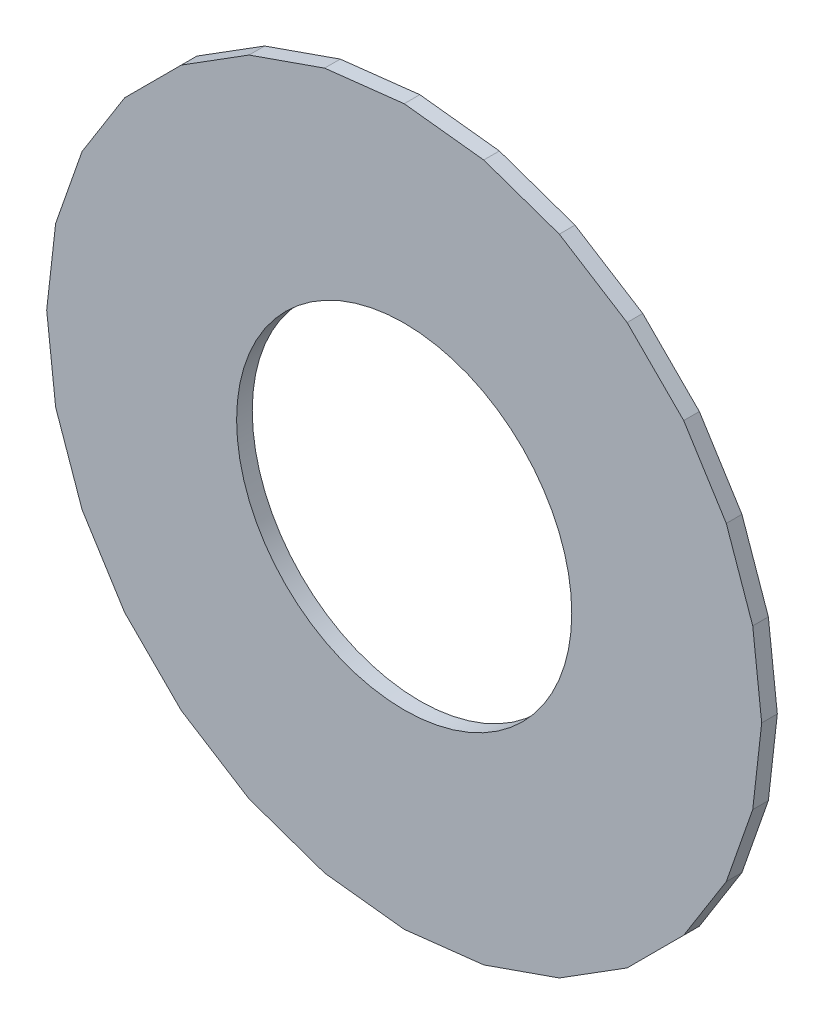
ISO-10303-21;
HEADER;
FILE_DESCRIPTION(('STEP AP214'),'2;1');
FILE_NAME('part.step','',(''),(''),'','','');
FILE_SCHEMA(('AUTOMOTIVE_DESIGN { 1 0 10303 214 1 1 1 1 }'));
ENDSEC;
DATA;
#1=APPLICATION_CONTEXT('core data for automotive mechanical design processes');
#2=APPLICATION_PROTOCOL_DEFINITION('international standard','automotive_design',2000,#1);
#3=PRODUCT_CONTEXT('',#1,'mechanical');
#4=PRODUCT('Part','Part','',(#3));
#5=PRODUCT_RELATED_PRODUCT_CATEGORY('part','',(#4));
#6=PRODUCT_DEFINITION_FORMATION('','',#4);
#7=PRODUCT_DEFINITION_CONTEXT('part definition',#1,'design');
#8=PRODUCT_DEFINITION('design','',#6,#7);
#9=PRODUCT_DEFINITION_SHAPE('','',#8);
#10=(LENGTH_UNIT() NAMED_UNIT(*) SI_UNIT(.MILLI.,.METRE.));
#11=(NAMED_UNIT(*) PLANE_ANGLE_UNIT() SI_UNIT($,.RADIAN.));
#12=(NAMED_UNIT(*) SI_UNIT($,.STERADIAN.) SOLID_ANGLE_UNIT());
#13=UNCERTAINTY_MEASURE_WITH_UNIT(LENGTH_MEASURE(1.E-05),#10,'distance_accuracy_value','');
#14=(GEOMETRIC_REPRESENTATION_CONTEXT(3) GLOBAL_UNCERTAINTY_ASSIGNED_CONTEXT((#13)) GLOBAL_UNIT_ASSIGNED_CONTEXT((#10,
#11,#12)) REPRESENTATION_CONTEXT('',''));
#15=CARTESIAN_POINT('',(0.,0.,0.));
#16=DIRECTION('',(0.,0.,1.));
#17=DIRECTION('',(1.,0.,0.));
#18=AXIS2_PLACEMENT_3D('',#15,#16,#17);
#19=CARTESIAN_POINT('',(170.307,-143.637,-0.045));
#20=DIRECTION('',(0.,0.,-1.));
#21=DIRECTION('',(0.,-1.,0.));
#22=AXIS2_PLACEMENT_3D('',#19,#20,#21);
#23=CYLINDRICAL_SURFACE('',#22,0.375);
#24=CARTESIAN_POINT('',(170.307,-143.637,1.67));
#25=DIRECTION('',(0.,0.,-1.));
#26=DIRECTION('',(0.,-1.,0.));
#27=AXIS2_PLACEMENT_3D('',#24,#25,#26);
#28=CIRCLE('',#27,0.375);
#29=CARTESIAN_POINT('',(170.307,-144.012,1.67));
#30=VERTEX_POINT('',#29);
#31=EDGE_CURVE('E292',#30,#30,#28,.T.);
#32=ORIENTED_EDGE('',*,*,#31,.T.);
#33=DIRECTION('',(0.,0.,1.));
#34=VECTOR('',#33,1.);
#35=CARTESIAN_POINT('',(170.307,-144.012,-0.045));
#36=LINE('',#35,#34);
#37=CARTESIAN_POINT('',(170.307,-144.012,1.705));
#38=VERTEX_POINT('',#37);
#39=EDGE_CURVE('E11',#30,#38,#36,.T.);
#40=ORIENTED_EDGE('',*,*,#39,.T.);
#41=CARTESIAN_POINT('',(170.307,-143.637,1.705));
#42=DIRECTION('',(0.,0.,-1.));
#43=DIRECTION('',(0.,-1.,0.));
#44=AXIS2_PLACEMENT_3D('',#41,#42,#43);
#45=CIRCLE('',#44,0.375);
#46=EDGE_CURVE('E378',#38,#38,#45,.T.);
#47=ORIENTED_EDGE('',*,*,#46,.F.);
#48=ORIENTED_EDGE('',*,*,#39,.F.);
#49=EDGE_LOOP('',(#32,#40,#47,#48));
#50=FACE_BOUND('',#49,.T.);
#51=ADVANCED_FACE('F17',(#50),#23,.F.);
#52=CARTESIAN_POINT('',(170.128983,-144.416942,1.67));
#53=DIRECTION('',(-0.330278315977027,-0.943883591337077,0.));
#54=DIRECTION('',(-0.943883591337077,0.330278315977027,0.));
#55=AXIS2_PLACEMENT_3D('',#52,#53,#54);
#56=PLANE('',#55);
#57=DIRECTION('',(0.,0.,1.));
#58=VECTOR('',#57,1.);
#59=CARTESIAN_POINT('',(170.128983,-144.416942,1.67));
#60=LINE('',#59,#58);
#61=CARTESIAN_POINT('',(170.128983,-144.416942,1.67));
#62=VERTEX_POINT('',#61);
#63=CARTESIAN_POINT('',(170.128983,-144.416942,1.705));
#64=VERTEX_POINT('',#63);
#65=EDGE_CURVE('E25',#62,#64,#60,.T.);
#66=ORIENTED_EDGE('',*,*,#65,.T.);
#67=DIRECTION('',(-0.943883591337077,0.330278315977027,0.));
#68=VECTOR('',#67,1.);
#69=CARTESIAN_POINT('',(170.128983,-144.416942,1.705));
#70=LINE('',#69,#68);
#71=CARTESIAN_POINT('',(169.959893,-144.357775,1.705));
#72=VERTEX_POINT('',#71);
#73=EDGE_CURVE('E211',#64,#72,#70,.T.);
#74=ORIENTED_EDGE('',*,*,#73,.T.);
#75=DIRECTION('',(0.,0.,1.));
#76=VECTOR('',#75,1.);
#77=CARTESIAN_POINT('',(169.959893,-144.357775,1.67));
#78=LINE('',#77,#76);
#79=CARTESIAN_POINT('',(169.959893,-144.357775,1.67));
#80=VERTEX_POINT('',#79);
#81=EDGE_CURVE('E139',#80,#72,#78,.T.);
#82=ORIENTED_EDGE('',*,*,#81,.F.);
#83=DIRECTION('',(-0.943883591337077,0.330278315977027,0.));
#84=VECTOR('',#83,1.);
#85=CARTESIAN_POINT('',(170.128983,-144.416942,1.67));
#86=LINE('',#85,#84);
#87=EDGE_CURVE('E215',#62,#80,#86,.T.);
#88=ORIENTED_EDGE('',*,*,#87,.F.);
#89=EDGE_LOOP('',(#66,#74,#82,#88));
#90=FACE_BOUND('',#89,.T.);
#91=ADVANCED_FACE('F208',(#90),#56,.T.);
#92=CARTESIAN_POINT('',(170.307,-144.437,1.67));
#93=DIRECTION('',(-0.111966136678988,-0.993712022789894,0.));
#94=DIRECTION('',(-0.993712022789894,0.111966136678988,0.));
#95=AXIS2_PLACEMENT_3D('',#92,#93,#94);
#96=PLANE('',#95);
#97=DIRECTION('',(0.,0.,1.));
#98=VECTOR('',#97,1.);
#99=CARTESIAN_POINT('',(170.307,-144.437,1.67));
#100=LINE('',#99,#98);
#101=CARTESIAN_POINT('',(170.307,-144.437,1.67));
#102=VERTEX_POINT('',#101);
#103=CARTESIAN_POINT('',(170.307,-144.437,1.705));
#104=VERTEX_POINT('',#103);
#105=EDGE_CURVE('E142',#102,#104,#100,.T.);
#106=ORIENTED_EDGE('',*,*,#105,.T.);
#107=DIRECTION('',(-0.993712022789894,0.111966136678988,0.));
#108=VECTOR('',#107,1.);
#109=CARTESIAN_POINT('',(170.307,-144.437,1.705));
#110=LINE('',#109,#108);
#111=EDGE_CURVE('E220',#104,#64,#110,.T.);
#112=ORIENTED_EDGE('',*,*,#111,.T.);
#113=ORIENTED_EDGE('',*,*,#65,.F.);
#114=DIRECTION('',(-0.993712022789894,0.111966136678988,0.));
#115=VECTOR('',#114,1.);
#116=CARTESIAN_POINT('',(170.307,-144.437,1.67));
#117=LINE('',#116,#115);
#118=EDGE_CURVE('E335',#102,#62,#117,.T.);
#119=ORIENTED_EDGE('',*,*,#118,.F.);
#120=EDGE_LOOP('',(#106,#112,#113,#119));
#121=FACE_BOUND('',#120,.T.);
#122=ADVANCED_FACE('F221',(#121),#96,.T.);
#123=CARTESIAN_POINT('',(169.959893,-144.357775,1.67));
#124=DIRECTION('',(-0.532032066600227,-0.846724205458361,0.));
#125=DIRECTION('',(-0.846724205458361,0.532032066600227,0.));
#126=AXIS2_PLACEMENT_3D('',#123,#124,#125);
#127=PLANE('',#126);
#128=ORIENTED_EDGE('',*,*,#81,.T.);
#129=DIRECTION('',(-0.846724205458361,0.532032066600227,0.));
#130=VECTOR('',#129,1.);
#131=CARTESIAN_POINT('',(169.959893,-144.357775,1.705));
#132=LINE('',#131,#130);
#133=CARTESIAN_POINT('',(169.808208,-144.262465,1.705));
#134=VERTEX_POINT('',#133);
#135=EDGE_CURVE('E230',#72,#134,#132,.T.);
#136=ORIENTED_EDGE('',*,*,#135,.T.);
#137=DIRECTION('',(0.,0.,1.));
#138=VECTOR('',#137,1.);
#139=CARTESIAN_POINT('',(169.808208,-144.262465,1.67));
#140=LINE('',#139,#138);
#141=CARTESIAN_POINT('',(169.808208,-144.262465,1.67));
#142=VERTEX_POINT('',#141);
#143=EDGE_CURVE('E195',#142,#134,#140,.T.);
#144=ORIENTED_EDGE('',*,*,#143,.F.);
#145=DIRECTION('',(-0.846724205458361,0.532032066600227,0.));
#146=VECTOR('',#145,1.);
#147=CARTESIAN_POINT('',(169.959893,-144.357775,1.67));
#148=LINE('',#147,#146);
#149=EDGE_CURVE('E343',#80,#142,#148,.T.);
#150=ORIENTED_EDGE('',*,*,#149,.F.);
#151=EDGE_LOOP('',(#128,#136,#144,#150));
#152=FACE_BOUND('',#151,.T.);
#153=ADVANCED_FACE('F914',(#152),#127,.T.);
#154=CARTESIAN_POINT('',(170.485017,-144.416942,1.67));
#155=DIRECTION('',(0.111966136678988,-0.993712022789894,0.));
#156=DIRECTION('',(0.,0.,-1.));
#157=AXIS2_PLACEMENT_3D('',#154,#155,#156);
#158=PLANE('',#157);
#159=DIRECTION('',(0.,0.,1.));
#160=VECTOR('',#159,1.);
#161=CARTESIAN_POINT('',(170.485017,-144.416942,1.67));
#162=LINE('',#161,#160);
#163=CARTESIAN_POINT('',(170.485017,-144.416942,1.67));
#164=VERTEX_POINT('',#163);
#165=CARTESIAN_POINT('',(170.485017,-144.416942,1.705));
#166=VERTEX_POINT('',#165);
#167=EDGE_CURVE('E174',#164,#166,#162,.T.);
#168=ORIENTED_EDGE('',*,*,#167,.T.);
#169=DIRECTION('',(-0.993712022789894,-0.111966136678988,0.));
#170=VECTOR('',#169,1.);
#171=CARTESIAN_POINT('',(170.485017,-144.416942,1.705));
#172=LINE('',#171,#170);
#173=EDGE_CURVE('E226',#166,#104,#172,.T.);
#174=ORIENTED_EDGE('',*,*,#173,.T.);
#175=ORIENTED_EDGE('',*,*,#105,.F.);
#176=DIRECTION('',(-0.993712022789894,-0.111966136678988,0.));
#177=VECTOR('',#176,1.);
#178=CARTESIAN_POINT('',(170.485017,-144.416942,1.67));
#179=LINE('',#178,#177);
#180=EDGE_CURVE('E331',#164,#102,#179,.T.);
#181=ORIENTED_EDGE('',*,*,#180,.F.);
#182=EDGE_LOOP('',(#168,#174,#175,#181));
#183=FACE_BOUND('',#182,.T.);
#184=ADVANCED_FACE('F739',(#183),#158,.T.);
#185=CARTESIAN_POINT('',(169.808208,-144.262465,1.67));
#186=DIRECTION('',(-0.707106781186048,-0.707106781187048,0.));
#187=DIRECTION('',(-0.707106781187048,0.707106781186048,0.));
#188=AXIS2_PLACEMENT_3D('',#185,#186,#187);
#189=PLANE('',#188);
#190=ORIENTED_EDGE('',*,*,#143,.T.);
#191=DIRECTION('',(-0.707106781187048,0.707106781186048,0.));
#192=VECTOR('',#191,1.);
#193=CARTESIAN_POINT('',(169.808208,-144.262465,1.705));
#194=LINE('',#193,#192);
#195=CARTESIAN_POINT('',(169.681535,-144.135792,1.705));
#196=VERTEX_POINT('',#195);
#197=EDGE_CURVE('E236',#134,#196,#194,.T.);
#198=ORIENTED_EDGE('',*,*,#197,.T.);
#199=DIRECTION('',(0.,0.,1.));
#200=VECTOR('',#199,1.);
#201=CARTESIAN_POINT('',(169.681535,-144.135792,1.67));
#202=LINE('',#201,#200);
#203=CARTESIAN_POINT('',(169.681535,-144.135792,1.67));
#204=VERTEX_POINT('',#203);
#205=EDGE_CURVE('E170',#204,#196,#202,.T.);
#206=ORIENTED_EDGE('',*,*,#205,.F.);
#207=DIRECTION('',(-0.707106781187048,0.707106781186048,0.));
#208=VECTOR('',#207,1.);
#209=CARTESIAN_POINT('',(169.808208,-144.262465,1.67));
#210=LINE('',#209,#208);
#211=EDGE_CURVE('E347',#142,#204,#210,.T.);
#212=ORIENTED_EDGE('',*,*,#211,.F.);
#213=EDGE_LOOP('',(#190,#198,#206,#212));
#214=FACE_BOUND('',#213,.T.);
#215=ADVANCED_FACE('F406',(#214),#189,.T.);
#216=CARTESIAN_POINT('',(170.654107,-144.357775,1.67));
#217=DIRECTION('',(0.330278315977027,-0.943883591337077,0.));
#218=DIRECTION('',(0.,0.,-1.));
#219=AXIS2_PLACEMENT_3D('',#216,#217,#218);
#220=PLANE('',#219);
#221=DIRECTION('',(0.,0.,1.));
#222=VECTOR('',#221,1.);
#223=CARTESIAN_POINT('',(170.654107,-144.357775,1.67));
#224=LINE('',#223,#222);
#225=CARTESIAN_POINT('',(170.654107,-144.357775,1.67));
#226=VERTEX_POINT('',#225);
#227=CARTESIAN_POINT('',(170.654107,-144.357775,1.705));
#228=VERTEX_POINT('',#227);
#229=EDGE_CURVE('E175',#226,#228,#224,.T.);
#230=ORIENTED_EDGE('',*,*,#229,.T.);
#231=DIRECTION('',(-0.943883591337077,-0.330278315977027,0.));
#232=VECTOR('',#231,1.);
#233=CARTESIAN_POINT('',(170.654107,-144.357775,1.705));
#234=LINE('',#233,#232);
#235=EDGE_CURVE('E242',#228,#166,#234,.T.);
#236=ORIENTED_EDGE('',*,*,#235,.T.);
#237=ORIENTED_EDGE('',*,*,#167,.F.);
#238=DIRECTION('',(-0.943883591337077,-0.330278315977027,0.));
#239=VECTOR('',#238,1.);
#240=CARTESIAN_POINT('',(170.654107,-144.357775,1.67));
#241=LINE('',#240,#239);
#242=EDGE_CURVE('E317',#226,#164,#241,.T.);
#243=ORIENTED_EDGE('',*,*,#242,.F.);
#244=EDGE_LOOP('',(#230,#236,#237,#243));
#245=FACE_BOUND('',#244,.T.);
#246=ADVANCED_FACE('F738',(#245),#220,.T.);
#247=CARTESIAN_POINT('',(169.681535,-144.135792,1.67));
#248=DIRECTION('',(-0.846724205458361,-0.532032066600227,0.));
#249=DIRECTION('',(-0.532032066600227,0.846724205458361,0.));
#250=AXIS2_PLACEMENT_3D('',#247,#248,#249);
#251=PLANE('',#250);
#252=ORIENTED_EDGE('',*,*,#205,.T.);
#253=DIRECTION('',(-0.532032066600227,0.846724205458361,0.));
#254=VECTOR('',#253,1.);
#255=CARTESIAN_POINT('',(169.681535,-144.135792,1.705));
#256=LINE('',#255,#254);
#257=CARTESIAN_POINT('',(169.586225,-143.984107,1.705));
#258=VERTEX_POINT('',#257);
#259=EDGE_CURVE('E394',#196,#258,#256,.T.);
#260=ORIENTED_EDGE('',*,*,#259,.T.);
#261=DIRECTION('',(0.,0.,1.));
#262=VECTOR('',#261,1.);
#263=CARTESIAN_POINT('',(169.586225,-143.984107,1.67));
#264=LINE('',#263,#262);
#265=CARTESIAN_POINT('',(169.586225,-143.984107,1.67));
#266=VERTEX_POINT('',#265);
#267=EDGE_CURVE('E191',#266,#258,#264,.T.);
#268=ORIENTED_EDGE('',*,*,#267,.F.);
#269=DIRECTION('',(-0.532032066600227,0.846724205458361,0.));
#270=VECTOR('',#269,1.);
#271=CARTESIAN_POINT('',(169.681535,-144.135792,1.67));
#272=LINE('',#271,#270);
#273=EDGE_CURVE('E351',#204,#266,#272,.T.);
#274=ORIENTED_EDGE('',*,*,#273,.F.);
#275=EDGE_LOOP('',(#252,#260,#268,#274));
#276=FACE_BOUND('',#275,.T.);
#277=ADVANCED_FACE('F418',(#276),#251,.T.);
#278=CARTESIAN_POINT('',(170.805792,-144.262465,1.67));
#279=DIRECTION('',(0.532032066600227,-0.846724205458361,0.));
#280=DIRECTION('',(0.,0.,-1.));
#281=AXIS2_PLACEMENT_3D('',#278,#279,#280);
#282=PLANE('',#281);
#283=DIRECTION('',(0.,0.,1.));
#284=VECTOR('',#283,1.);
#285=CARTESIAN_POINT('',(170.805792,-144.262465,1.67));
#286=LINE('',#285,#284);
#287=CARTESIAN_POINT('',(170.805792,-144.262465,1.67));
#288=VERTEX_POINT('',#287);
#289=CARTESIAN_POINT('',(170.805792,-144.262465,1.705));
#290=VERTEX_POINT('',#289);
#291=EDGE_CURVE('E188',#288,#290,#286,.T.);
#292=ORIENTED_EDGE('',*,*,#291,.T.);
#293=DIRECTION('',(-0.846724205458361,-0.532032066600227,0.));
#294=VECTOR('',#293,1.);
#295=CARTESIAN_POINT('',(170.805792,-144.262465,1.705));
#296=LINE('',#295,#294);
#297=EDGE_CURVE('E243',#290,#228,#296,.T.);
#298=ORIENTED_EDGE('',*,*,#297,.T.);
#299=ORIENTED_EDGE('',*,*,#229,.F.);
#300=DIRECTION('',(-0.846724205458361,-0.532032066600227,0.));
#301=VECTOR('',#300,1.);
#302=CARTESIAN_POINT('',(170.805792,-144.262465,1.67));
#303=LINE('',#302,#301);
#304=EDGE_CURVE('E309',#288,#226,#303,.T.);
#305=ORIENTED_EDGE('',*,*,#304,.F.);
#306=EDGE_LOOP('',(#292,#298,#299,#305));
#307=FACE_BOUND('',#306,.T.);
#308=ADVANCED_FACE('F691',(#307),#282,.T.);
#309=CARTESIAN_POINT('',(169.586225,-143.984107,1.67));
#310=DIRECTION('',(-0.943883591336766,-0.330278315977918,0.));
#311=DIRECTION('',(-0.330278315977918,0.943883591336766,0.));
#312=AXIS2_PLACEMENT_3D('',#309,#310,#311);
#313=PLANE('',#312);
#314=ORIENTED_EDGE('',*,*,#267,.T.);
#315=DIRECTION('',(-0.330278315977918,0.943883591336766,0.));
#316=VECTOR('',#315,1.);
#317=CARTESIAN_POINT('',(169.586225,-143.984107,1.705));
#318=LINE('',#317,#316);
#319=CARTESIAN_POINT('',(169.527058,-143.815017,1.705));
#320=VERTEX_POINT('',#319);
#321=EDGE_CURVE('E326',#258,#320,#318,.T.);
#322=ORIENTED_EDGE('',*,*,#321,.T.);
#323=DIRECTION('',(0.,0.,1.));
#324=VECTOR('',#323,1.);
#325=CARTESIAN_POINT('',(169.527058,-143.815017,1.67));
#326=LINE('',#325,#324);
#327=CARTESIAN_POINT('',(169.527058,-143.815017,1.67));
#328=VERTEX_POINT('',#327);
#329=EDGE_CURVE('E184',#328,#320,#326,.T.);
#330=ORIENTED_EDGE('',*,*,#329,.F.);
#331=DIRECTION('',(-0.330278315977918,0.943883591336766,0.));
#332=VECTOR('',#331,1.);
#333=CARTESIAN_POINT('',(169.586225,-143.984107,1.67));
#334=LINE('',#333,#332);
#335=EDGE_CURVE('E361',#266,#328,#334,.T.);
#336=ORIENTED_EDGE('',*,*,#335,.F.);
#337=EDGE_LOOP('',(#314,#322,#330,#336));
#338=FACE_BOUND('',#337,.T.);
#339=ADVANCED_FACE('F688',(#338),#313,.T.);
#340=CARTESIAN_POINT('',(170.932465,-144.135792,1.67));
#341=DIRECTION('',(0.707106781186048,-0.707106781187048,0.));
#342=DIRECTION('',(0.,0.,-1.));
#343=AXIS2_PLACEMENT_3D('',#340,#341,#342);
#344=PLANE('',#343);
#345=DIRECTION('',(0.,0.,1.));
#346=VECTOR('',#345,1.);
#347=CARTESIAN_POINT('',(170.932465,-144.135792,1.67));
#348=LINE('',#347,#346);
#349=CARTESIAN_POINT('',(170.932465,-144.135792,1.67));
#350=VERTEX_POINT('',#349);
#351=CARTESIAN_POINT('',(170.932465,-144.135792,1.705));
#352=VERTEX_POINT('',#351);
#353=EDGE_CURVE('E183',#350,#352,#348,.T.);
#354=ORIENTED_EDGE('',*,*,#353,.T.);
#355=DIRECTION('',(-0.707106781187048,-0.707106781186048,0.));
#356=VECTOR('',#355,1.);
#357=CARTESIAN_POINT('',(170.932465,-144.135792,1.705));
#358=LINE('',#357,#356);
#359=EDGE_CURVE('E246',#352,#290,#358,.T.);
#360=ORIENTED_EDGE('',*,*,#359,.T.);
#361=ORIENTED_EDGE('',*,*,#291,.F.);
#362=DIRECTION('',(-0.707106781187048,-0.707106781186048,0.));
#363=VECTOR('',#362,1.);
#364=CARTESIAN_POINT('',(170.932465,-144.135792,1.67));
#365=LINE('',#364,#363);
#366=EDGE_CURVE('E305',#350,#288,#365,.T.);
#367=ORIENTED_EDGE('',*,*,#366,.F.);
#368=EDGE_LOOP('',(#354,#360,#361,#367));
#369=FACE_BOUND('',#368,.T.);
#370=ADVANCED_FACE('F690',(#369),#344,.T.);
#371=CARTESIAN_POINT('',(169.527058,-143.815017,1.67));
#372=DIRECTION('',(-0.993712022789894,-0.111966136678988,0.));
#373=DIRECTION('',(-0.111966136678988,0.993712022789894,0.));
#374=AXIS2_PLACEMENT_3D('',#371,#372,#373);
#375=PLANE('',#374);
#376=ORIENTED_EDGE('',*,*,#329,.T.);
#377=DIRECTION('',(-0.111966136678988,0.993712022789894,0.));
#378=VECTOR('',#377,1.);
#379=CARTESIAN_POINT('',(169.527058,-143.815017,1.705));
#380=LINE('',#379,#378);
#381=CARTESIAN_POINT('',(169.507,-143.637,1.705));
#382=VERTEX_POINT('',#381);
#383=EDGE_CURVE('E322',#320,#382,#380,.T.);
#384=ORIENTED_EDGE('',*,*,#383,.T.);
#385=DIRECTION('',(0.,0.,1.));
#386=VECTOR('',#385,1.);
#387=CARTESIAN_POINT('',(169.507,-143.637,1.67));
#388=LINE('',#387,#386);
#389=CARTESIAN_POINT('',(169.507,-143.637,1.67));
#390=VERTEX_POINT('',#389);
#391=EDGE_CURVE('E163',#390,#382,#388,.T.);
#392=ORIENTED_EDGE('',*,*,#391,.F.);
#393=DIRECTION('',(-0.111966136678988,0.993712022789894,0.));
#394=VECTOR('',#393,1.);
#395=CARTESIAN_POINT('',(169.527058,-143.815017,1.67));
#396=LINE('',#395,#394);
#397=EDGE_CURVE('E365',#328,#390,#396,.T.);
#398=ORIENTED_EDGE('',*,*,#397,.F.);
#399=EDGE_LOOP('',(#376,#384,#392,#398));
#400=FACE_BOUND('',#399,.T.);
#401=ADVANCED_FACE('F687',(#400),#375,.T.);
#402=CARTESIAN_POINT('',(171.027775,-143.984107,1.67));
#403=DIRECTION('',(0.846724205458361,-0.532032066600227,0.));
#404=DIRECTION('',(0.,0.,-1.));
#405=AXIS2_PLACEMENT_3D('',#402,#403,#404);
#406=PLANE('',#405);
#407=DIRECTION('',(0.,0.,1.));
#408=VECTOR('',#407,1.);
#409=CARTESIAN_POINT('',(171.027775,-143.984107,1.67));
#410=LINE('',#409,#408);
#411=CARTESIAN_POINT('',(171.027775,-143.984107,1.67));
#412=VERTEX_POINT('',#411);
#413=CARTESIAN_POINT('',(171.027775,-143.984107,1.705));
#414=VERTEX_POINT('',#413);
#415=EDGE_CURVE('E160',#412,#414,#410,.T.);
#416=ORIENTED_EDGE('',*,*,#415,.T.);
#417=DIRECTION('',(-0.532032066600227,-0.846724205458361,0.));
#418=VECTOR('',#417,1.);
#419=CARTESIAN_POINT('',(171.027775,-143.984107,1.705));
#420=LINE('',#419,#418);
#421=EDGE_CURVE('E135',#414,#352,#420,.T.);
#422=ORIENTED_EDGE('',*,*,#421,.T.);
#423=ORIENTED_EDGE('',*,*,#353,.F.);
#424=DIRECTION('',(-0.532032066600227,-0.846724205458361,0.));
#425=VECTOR('',#424,1.);
#426=CARTESIAN_POINT('',(171.027775,-143.984107,1.67));
#427=LINE('',#426,#425);
#428=EDGE_CURVE('E301',#412,#350,#427,.T.);
#429=ORIENTED_EDGE('',*,*,#428,.F.);
#430=EDGE_LOOP('',(#416,#422,#423,#429));
#431=FACE_BOUND('',#430,.T.);
#432=ADVANCED_FACE('F748',(#431),#406,.T.);
#433=CARTESIAN_POINT('',(169.507,-143.637,1.67));
#434=DIRECTION('',(-0.993712022789894,0.111966136678988,0.));
#435=DIRECTION('',(0.,0.,1.));
#436=AXIS2_PLACEMENT_3D('',#433,#434,#435);
#437=PLANE('',#436);
#438=ORIENTED_EDGE('',*,*,#391,.T.);
#439=DIRECTION('',(0.111966136678988,0.993712022789894,0.));
#440=VECTOR('',#439,1.);
#441=CARTESIAN_POINT('',(169.507,-143.637,1.705));
#442=LINE('',#441,#440);
#443=CARTESIAN_POINT('',(169.527058,-143.458983,1.705));
#444=VERTEX_POINT('',#443);
#445=EDGE_CURVE('E327',#382,#444,#442,.T.);
#446=ORIENTED_EDGE('',*,*,#445,.T.);
#447=DIRECTION('',(0.,0.,1.));
#448=VECTOR('',#447,1.);
#449=CARTESIAN_POINT('',(169.527058,-143.458983,1.67));
#450=LINE('',#449,#448);
#451=CARTESIAN_POINT('',(169.527058,-143.458983,1.67));
#452=VERTEX_POINT('',#451);
#453=EDGE_CURVE('E164',#452,#444,#450,.T.);
#454=ORIENTED_EDGE('',*,*,#453,.F.);
#455=DIRECTION('',(0.111966136678988,0.993712022789894,0.));
#456=VECTOR('',#455,1.);
#457=CARTESIAN_POINT('',(169.507,-143.637,1.67));
#458=LINE('',#457,#456);
#459=EDGE_CURVE('E368',#390,#452,#458,.T.);
#460=ORIENTED_EDGE('',*,*,#459,.F.);
#461=EDGE_LOOP('',(#438,#446,#454,#460));
#462=FACE_BOUND('',#461,.T.);
#463=ADVANCED_FACE('F684',(#462),#437,.T.);
#464=CARTESIAN_POINT('',(171.086942,-143.815017,1.67));
#465=DIRECTION('',(0.943883591336766,-0.330278315977918,0.));
#466=DIRECTION('',(0.,0.,-1.));
#467=AXIS2_PLACEMENT_3D('',#464,#465,#466);
#468=PLANE('',#467);
#469=DIRECTION('',(0.,0.,1.));
#470=VECTOR('',#469,1.);
#471=CARTESIAN_POINT('',(171.086942,-143.815017,1.67));
#472=LINE('',#471,#470);
#473=CARTESIAN_POINT('',(171.086942,-143.815017,1.67));
#474=VERTEX_POINT('',#473);
#475=CARTESIAN_POINT('',(171.086942,-143.815017,1.705));
#476=VERTEX_POINT('',#475);
#477=EDGE_CURVE('E179',#474,#476,#472,.T.);
#478=ORIENTED_EDGE('',*,*,#477,.T.);
#479=DIRECTION('',(-0.330278315977918,-0.943883591336766,0.));
#480=VECTOR('',#479,1.);
#481=CARTESIAN_POINT('',(171.086942,-143.815017,1.705));
#482=LINE('',#481,#480);
#483=EDGE_CURVE('E128',#476,#414,#482,.T.);
#484=ORIENTED_EDGE('',*,*,#483,.T.);
#485=ORIENTED_EDGE('',*,*,#415,.F.);
#486=DIRECTION('',(-0.330278315977918,-0.943883591336766,0.));
#487=VECTOR('',#486,1.);
#488=CARTESIAN_POINT('',(171.086942,-143.815017,1.67));
#489=LINE('',#488,#487);
#490=EDGE_CURVE('E265',#474,#412,#489,.T.);
#491=ORIENTED_EDGE('',*,*,#490,.F.);
#492=EDGE_LOOP('',(#478,#484,#485,#491));
#493=FACE_BOUND('',#492,.T.);
#494=ADVANCED_FACE('F742',(#493),#468,.T.);
#495=CARTESIAN_POINT('',(169.527058,-143.458983,1.67));
#496=DIRECTION('',(-0.943883591336766,0.330278315977918,0.));
#497=DIRECTION('',(0.,0.,1.));
#498=AXIS2_PLACEMENT_3D('',#495,#496,#497);
#499=PLANE('',#498);
#500=ORIENTED_EDGE('',*,*,#453,.T.);
#501=DIRECTION('',(0.330278315977918,0.943883591336766,0.));
#502=VECTOR('',#501,1.);
#503=CARTESIAN_POINT('',(169.527058,-143.458983,1.705));
#504=LINE('',#503,#502);
#505=CARTESIAN_POINT('',(169.586225,-143.289893,1.705));
#506=VERTEX_POINT('',#505);
#507=EDGE_CURVE('E286',#444,#506,#504,.T.);
#508=ORIENTED_EDGE('',*,*,#507,.T.);
#509=DIRECTION('',(0.,0.,1.));
#510=VECTOR('',#509,1.);
#511=CARTESIAN_POINT('',(169.586225,-143.289893,1.67));
#512=LINE('',#511,#510);
#513=CARTESIAN_POINT('',(169.586225,-143.289893,1.67));
#514=VERTEX_POINT('',#513);
#515=EDGE_CURVE('E110',#514,#506,#512,.T.);
#516=ORIENTED_EDGE('',*,*,#515,.F.);
#517=DIRECTION('',(0.330278315977918,0.943883591336766,0.));
#518=VECTOR('',#517,1.);
#519=CARTESIAN_POINT('',(169.527058,-143.458983,1.67));
#520=LINE('',#519,#518);
#521=EDGE_CURVE('E374',#452,#514,#520,.T.);
#522=ORIENTED_EDGE('',*,*,#521,.F.);
#523=EDGE_LOOP('',(#500,#508,#516,#522));
#524=FACE_BOUND('',#523,.T.);
#525=ADVANCED_FACE('F679',(#524),#499,.T.);
#526=CARTESIAN_POINT('',(171.107,-143.637,1.67));
#527=DIRECTION('',(0.993712022789894,-0.111966136678988,0.));
#528=DIRECTION('',(0.,0.,-1.));
#529=AXIS2_PLACEMENT_3D('',#526,#527,#528);
#530=PLANE('',#529);
#531=DIRECTION('',(0.,0.,1.));
#532=VECTOR('',#531,1.);
#533=CARTESIAN_POINT('',(171.107,-143.637,1.67));
#534=LINE('',#533,#532);
#535=CARTESIAN_POINT('',(171.107,-143.637,1.67));
#536=VERTEX_POINT('',#535);
#537=CARTESIAN_POINT('',(171.107,-143.637,1.705));
#538=VERTEX_POINT('',#537);
#539=EDGE_CURVE('E96',#536,#538,#534,.T.);
#540=ORIENTED_EDGE('',*,*,#539,.T.);
#541=DIRECTION('',(-0.111966136678988,-0.993712022789894,0.));
#542=VECTOR('',#541,1.);
#543=CARTESIAN_POINT('',(171.107,-143.637,1.705));
#544=LINE('',#543,#542);
#545=EDGE_CURVE('E101',#538,#476,#544,.T.);
#546=ORIENTED_EDGE('',*,*,#545,.T.);
#547=ORIENTED_EDGE('',*,*,#477,.F.);
#548=DIRECTION('',(-0.111966136678988,-0.993712022789894,0.));
#549=VECTOR('',#548,1.);
#550=CARTESIAN_POINT('',(171.107,-143.637,1.67));
#551=LINE('',#550,#549);
#552=EDGE_CURVE('E105',#536,#474,#551,.T.);
#553=ORIENTED_EDGE('',*,*,#552,.F.);
#554=EDGE_LOOP('',(#540,#546,#547,#553));
#555=FACE_BOUND('',#554,.T.);
#556=ADVANCED_FACE('F98',(#555),#530,.T.);
#557=CARTESIAN_POINT('',(169.586225,-143.289893,1.67));
#558=DIRECTION('',(-0.846724205458361,0.532032066600227,0.));
#559=DIRECTION('',(0.,0.,1.));
#560=AXIS2_PLACEMENT_3D('',#557,#558,#559);
#561=PLANE('',#560);
#562=ORIENTED_EDGE('',*,*,#515,.T.);
#563=DIRECTION('',(0.532032066600227,0.846724205458361,0.));
#564=VECTOR('',#563,1.);
#565=CARTESIAN_POINT('',(169.586225,-143.289893,1.705));
#566=LINE('',#565,#564);
#567=CARTESIAN_POINT('',(169.681535,-143.138208,1.705));
#568=VERTEX_POINT('',#567);
#569=EDGE_CURVE('E282',#506,#568,#566,.T.);
#570=ORIENTED_EDGE('',*,*,#569,.T.);
#571=DIRECTION('',(0.,0.,1.));
#572=VECTOR('',#571,1.);
#573=CARTESIAN_POINT('',(169.681535,-143.138208,1.67));
#574=LINE('',#573,#572);
#575=CARTESIAN_POINT('',(169.681535,-143.138208,1.67));
#576=VERTEX_POINT('',#575);
#577=EDGE_CURVE('E111',#576,#568,#574,.T.);
#578=ORIENTED_EDGE('',*,*,#577,.F.);
#579=DIRECTION('',(0.532032066600227,0.846724205458361,0.));
#580=VECTOR('',#579,1.);
#581=CARTESIAN_POINT('',(169.586225,-143.289893,1.67));
#582=LINE('',#581,#580);
#583=EDGE_CURVE('E370',#514,#576,#582,.T.);
#584=ORIENTED_EDGE('',*,*,#583,.F.);
#585=EDGE_LOOP('',(#562,#570,#578,#584));
#586=FACE_BOUND('',#585,.T.);
#587=ADVANCED_FACE('F675',(#586),#561,.T.);
#588=CARTESIAN_POINT('',(171.086942,-143.458983,1.67));
#589=DIRECTION('',(0.993712022789894,0.111966136678988,0.));
#590=DIRECTION('',(0.,0.,-1.));
#591=AXIS2_PLACEMENT_3D('',#588,#589,#590);
#592=PLANE('',#591);
#593=DIRECTION('',(0.,0.,1.));
#594=VECTOR('',#593,1.);
#595=CARTESIAN_POINT('',(171.086942,-143.458983,1.67));
#596=LINE('',#595,#594);
#597=CARTESIAN_POINT('',(171.086942,-143.458983,1.67));
#598=VERTEX_POINT('',#597);
#599=CARTESIAN_POINT('',(171.086942,-143.458983,1.705));
#600=VERTEX_POINT('',#599);
#601=EDGE_CURVE('E117',#598,#600,#596,.T.);
#602=ORIENTED_EDGE('',*,*,#601,.T.);
#603=DIRECTION('',(0.111966136678988,-0.993712022789894,0.));
#604=VECTOR('',#603,1.);
#605=CARTESIAN_POINT('',(171.086942,-143.458983,1.705));
#606=LINE('',#605,#604);
#607=EDGE_CURVE('E114',#600,#538,#606,.T.);
#608=ORIENTED_EDGE('',*,*,#607,.T.);
#609=ORIENTED_EDGE('',*,*,#539,.F.);
#610=DIRECTION('',(0.111966136678988,-0.993712022789894,0.));
#611=VECTOR('',#610,1.);
#612=CARTESIAN_POINT('',(171.086942,-143.458983,1.67));
#613=LINE('',#612,#611);
#614=EDGE_CURVE('E291',#598,#536,#613,.T.);
#615=ORIENTED_EDGE('',*,*,#614,.F.);
#616=EDGE_LOOP('',(#602,#608,#609,#615));
#617=FACE_BOUND('',#616,.T.);
#618=ADVANCED_FACE('F115',(#617),#592,.T.);
#619=CARTESIAN_POINT('',(169.681535,-143.138208,1.67));
#620=DIRECTION('',(-0.707106781186048,0.707106781187048,0.));
#621=DIRECTION('',(0.,0.,1.));
#622=AXIS2_PLACEMENT_3D('',#619,#620,#621);
#623=PLANE('',#622);
#624=ORIENTED_EDGE('',*,*,#577,.T.);
#625=DIRECTION('',(0.707106781187048,0.707106781186048,0.));
#626=VECTOR('',#625,1.);
#627=CARTESIAN_POINT('',(169.681535,-143.138208,1.705));
#628=LINE('',#627,#626);
#629=CARTESIAN_POINT('',(169.808208,-143.011535,1.705));
#630=VERTEX_POINT('',#629);
#631=EDGE_CURVE('E287',#568,#630,#628,.T.);
#632=ORIENTED_EDGE('',*,*,#631,.T.);
#633=DIRECTION('',(0.,0.,1.));
#634=VECTOR('',#633,1.);
#635=CARTESIAN_POINT('',(169.808208,-143.011535,1.67));
#636=LINE('',#635,#634);
#637=CARTESIAN_POINT('',(169.808208,-143.011535,1.67));
#638=VERTEX_POINT('',#637);
#639=EDGE_CURVE('E156',#638,#630,#636,.T.);
#640=ORIENTED_EDGE('',*,*,#639,.F.);
#641=DIRECTION('',(0.707106781187048,0.707106781186048,0.));
#642=VECTOR('',#641,1.);
#643=CARTESIAN_POINT('',(169.681535,-143.138208,1.67));
#644=LINE('',#643,#642);
#645=EDGE_CURVE('E357',#576,#638,#644,.T.);
#646=ORIENTED_EDGE('',*,*,#645,.F.);
#647=EDGE_LOOP('',(#624,#632,#640,#646));
#648=FACE_BOUND('',#647,.T.);
#649=ADVANCED_FACE('F672',(#648),#623,.T.);
#650=CARTESIAN_POINT('',(171.027775,-143.289893,1.67));
#651=DIRECTION('',(0.943883591336766,0.330278315977918,0.));
#652=DIRECTION('',(0.,0.,-1.));
#653=AXIS2_PLACEMENT_3D('',#650,#651,#652);
#654=PLANE('',#653);
#655=DIRECTION('',(0.,0.,1.));
#656=VECTOR('',#655,1.);
#657=CARTESIAN_POINT('',(171.027775,-143.289893,1.67));
#658=LINE('',#657,#656);
#659=CARTESIAN_POINT('',(171.027775,-143.289893,1.67));
#660=VERTEX_POINT('',#659);
#661=CARTESIAN_POINT('',(171.027775,-143.289893,1.705));
#662=VERTEX_POINT('',#661);
#663=EDGE_CURVE('E153',#660,#662,#658,.T.);
#664=ORIENTED_EDGE('',*,*,#663,.T.);
#665=DIRECTION('',(0.330278315977918,-0.943883591336766,0.));
#666=VECTOR('',#665,1.);
#667=CARTESIAN_POINT('',(171.027775,-143.289893,1.705));
#668=LINE('',#667,#666);
#669=EDGE_CURVE('E122',#662,#600,#668,.T.);
#670=ORIENTED_EDGE('',*,*,#669,.T.);
#671=ORIENTED_EDGE('',*,*,#601,.F.);
#672=DIRECTION('',(0.330278315977918,-0.943883591336766,0.));
#673=VECTOR('',#672,1.);
#674=CARTESIAN_POINT('',(171.027775,-143.289893,1.67));
#675=LINE('',#674,#673);
#676=EDGE_CURVE('E278',#660,#598,#675,.T.);
#677=ORIENTED_EDGE('',*,*,#676,.F.);
#678=EDGE_LOOP('',(#664,#670,#671,#677));
#679=FACE_BOUND('',#678,.T.);
#680=ADVANCED_FACE('F656',(#679),#654,.T.);
#681=CARTESIAN_POINT('',(169.808208,-143.011535,1.67));
#682=DIRECTION('',(-0.532032066600227,0.846724205458361,0.));
#683=DIRECTION('',(0.,0.,1.));
#684=AXIS2_PLACEMENT_3D('',#681,#682,#683);
#685=PLANE('',#684);
#686=ORIENTED_EDGE('',*,*,#639,.T.);
#687=DIRECTION('',(0.846724205458361,0.532032066600227,0.));
#688=VECTOR('',#687,1.);
#689=CARTESIAN_POINT('',(169.808208,-143.011535,1.705));
#690=LINE('',#689,#688);
#691=CARTESIAN_POINT('',(169.959893,-142.916225,1.705));
#692=VERTEX_POINT('',#691);
#693=EDGE_CURVE('E385',#630,#692,#690,.T.);
#694=ORIENTED_EDGE('',*,*,#693,.T.);
#695=DIRECTION('',(0.,0.,1.));
#696=VECTOR('',#695,1.);
#697=CARTESIAN_POINT('',(169.959893,-142.916225,1.67));
#698=LINE('',#697,#696);
#699=CARTESIAN_POINT('',(169.959893,-142.916225,1.67));
#700=VERTEX_POINT('',#699);
#701=EDGE_CURVE('E149',#700,#692,#698,.T.);
#702=ORIENTED_EDGE('',*,*,#701,.F.);
#703=DIRECTION('',(0.846724205458361,0.532032066600227,0.));
#704=VECTOR('',#703,1.);
#705=CARTESIAN_POINT('',(169.808208,-143.011535,1.67));
#706=LINE('',#705,#704);
#707=EDGE_CURVE('E352',#638,#700,#706,.T.);
#708=ORIENTED_EDGE('',*,*,#707,.F.);
#709=EDGE_LOOP('',(#686,#694,#702,#708));
#710=FACE_BOUND('',#709,.T.);
#711=ADVANCED_FACE('F668',(#710),#685,.T.);
#712=CARTESIAN_POINT('',(170.932465,-143.138208,1.67));
#713=DIRECTION('',(0.846724205458361,0.532032066600227,0.));
#714=DIRECTION('',(0.,0.,-1.));
#715=AXIS2_PLACEMENT_3D('',#712,#713,#714);
#716=PLANE('',#715);
#717=DIRECTION('',(0.,0.,1.));
#718=VECTOR('',#717,1.);
#719=CARTESIAN_POINT('',(170.932465,-143.138208,1.67));
#720=LINE('',#719,#718);
#721=CARTESIAN_POINT('',(170.932465,-143.138208,1.67));
#722=VERTEX_POINT('',#721);
#723=CARTESIAN_POINT('',(170.932465,-143.138208,1.705));
#724=VERTEX_POINT('',#723);
#725=EDGE_CURVE('E48',#722,#724,#720,.T.);
#726=ORIENTED_EDGE('',*,*,#725,.T.);
#727=DIRECTION('',(0.532032066600227,-0.846724205458361,0.));
#728=VECTOR('',#727,1.);
#729=CARTESIAN_POINT('',(170.932465,-143.138208,1.705));
#730=LINE('',#729,#728);
#731=EDGE_CURVE('E145',#724,#662,#730,.T.);
#732=ORIENTED_EDGE('',*,*,#731,.T.);
#733=ORIENTED_EDGE('',*,*,#663,.F.);
#734=DIRECTION('',(0.532032066600227,-0.846724205458361,0.));
#735=VECTOR('',#734,1.);
#736=CARTESIAN_POINT('',(170.932465,-143.138208,1.67));
#737=LINE('',#736,#735);
#738=EDGE_CURVE('E271',#722,#660,#737,.T.);
#739=ORIENTED_EDGE('',*,*,#738,.F.);
#740=EDGE_LOOP('',(#726,#732,#733,#739));
#741=FACE_BOUND('',#740,.T.);
#742=ADVANCED_FACE('F653',(#741),#716,.T.);
#743=CARTESIAN_POINT('',(169.959893,-142.916225,1.67));
#744=DIRECTION('',(-0.330278315977027,0.943883591337077,0.));
#745=DIRECTION('',(0.,0.,1.));
#746=AXIS2_PLACEMENT_3D('',#743,#744,#745);
#747=PLANE('',#746);
#748=ORIENTED_EDGE('',*,*,#701,.T.);
#749=DIRECTION('',(0.943883591337077,0.330278315977027,0.));
#750=VECTOR('',#749,1.);
#751=CARTESIAN_POINT('',(169.959893,-142.916225,1.705));
#752=LINE('',#751,#750);
#753=CARTESIAN_POINT('',(170.128983,-142.857058,1.705));
#754=VERTEX_POINT('',#753);
#755=EDGE_CURVE('E313',#692,#754,#752,.T.);
#756=ORIENTED_EDGE('',*,*,#755,.T.);
#757=DIRECTION('',(0.,0.,1.));
#758=VECTOR('',#757,1.);
#759=CARTESIAN_POINT('',(170.128983,-142.857058,1.67));
#760=LINE('',#759,#758);
#761=CARTESIAN_POINT('',(170.128983,-142.857058,1.67));
#762=VERTEX_POINT('',#761);
#763=EDGE_CURVE('E381',#762,#754,#760,.T.);
#764=ORIENTED_EDGE('',*,*,#763,.F.);
#765=DIRECTION('',(0.943883591337077,0.330278315977027,0.));
#766=VECTOR('',#765,1.);
#767=CARTESIAN_POINT('',(169.959893,-142.916225,1.67));
#768=LINE('',#767,#766);
#769=EDGE_CURVE('E356',#700,#762,#768,.T.);
#770=ORIENTED_EDGE('',*,*,#769,.F.);
#771=EDGE_LOOP('',(#748,#756,#764,#770));
#772=FACE_BOUND('',#771,.T.);
#773=ADVANCED_FACE('F663',(#772),#747,.T.);
#774=CARTESIAN_POINT('',(170.805792,-143.011535,1.67));
#775=DIRECTION('',(0.707106781186048,0.707106781187048,0.));
#776=DIRECTION('',(0.,0.,-1.));
#777=AXIS2_PLACEMENT_3D('',#774,#775,#776);
#778=PLANE('',#777);
#779=DIRECTION('',(0.,0.,1.));
#780=VECTOR('',#779,1.);
#781=CARTESIAN_POINT('',(170.805792,-143.011535,1.67));
#782=LINE('',#781,#780);
#783=CARTESIAN_POINT('',(170.805792,-143.011535,1.67));
#784=VERTEX_POINT('',#783);
#785=CARTESIAN_POINT('',(170.805792,-143.011535,1.705));
#786=VERTEX_POINT('',#785);
#787=EDGE_CURVE('E622',#784,#786,#782,.T.);
#788=ORIENTED_EDGE('',*,*,#787,.T.);
#789=DIRECTION('',(0.707106781187048,-0.707106781186048,0.));
#790=VECTOR('',#789,1.);
#791=CARTESIAN_POINT('',(170.805792,-143.011535,1.705));
#792=LINE('',#791,#790);
#793=EDGE_CURVE('E148',#786,#724,#792,.T.);
#794=ORIENTED_EDGE('',*,*,#793,.T.);
#795=ORIENTED_EDGE('',*,*,#725,.F.);
#796=DIRECTION('',(0.707106781187048,-0.707106781186048,0.));
#797=VECTOR('',#796,1.);
#798=CARTESIAN_POINT('',(170.805792,-143.011535,1.67));
#799=LINE('',#798,#797);
#800=EDGE_CURVE('E267',#784,#722,#799,.T.);
#801=ORIENTED_EDGE('',*,*,#800,.F.);
#802=EDGE_LOOP('',(#788,#794,#795,#801));
#803=FACE_BOUND('',#802,.T.);
#804=ADVANCED_FACE('F651',(#803),#778,.T.);
#805=CARTESIAN_POINT('',(170.128983,-142.857058,1.67));
#806=DIRECTION('',(-0.111966136678988,0.993712022789894,0.));
#807=DIRECTION('',(0.,0.,1.));
#808=AXIS2_PLACEMENT_3D('',#805,#806,#807);
#809=PLANE('',#808);
#810=ORIENTED_EDGE('',*,*,#763,.T.);
#811=DIRECTION('',(0.993712022789894,0.111966136678988,0.));
#812=VECTOR('',#811,1.);
#813=CARTESIAN_POINT('',(170.128983,-142.857058,1.705));
#814=LINE('',#813,#812);
#815=CARTESIAN_POINT('',(170.307,-142.837,1.705));
#816=VERTEX_POINT('',#815);
#817=EDGE_CURVE('E295',#754,#816,#814,.T.);
#818=ORIENTED_EDGE('',*,*,#817,.T.);
#819=DIRECTION('',(0.,0.,1.));
#820=VECTOR('',#819,1.);
#821=CARTESIAN_POINT('',(170.307,-142.837,1.67));
#822=LINE('',#821,#820);
#823=CARTESIAN_POINT('',(170.307,-142.837,1.67));
#824=VERTEX_POINT('',#823);
#825=EDGE_CURVE('E597',#824,#816,#822,.T.);
#826=ORIENTED_EDGE('',*,*,#825,.F.);
#827=DIRECTION('',(0.993712022789894,0.111966136678988,0.));
#828=VECTOR('',#827,1.);
#829=CARTESIAN_POINT('',(170.128983,-142.857058,1.67));
#830=LINE('',#829,#828);
#831=EDGE_CURVE('E296',#762,#824,#830,.T.);
#832=ORIENTED_EDGE('',*,*,#831,.F.);
#833=EDGE_LOOP('',(#810,#818,#826,#832));
#834=FACE_BOUND('',#833,.T.);
#835=ADVANCED_FACE('F660',(#834),#809,.T.);
#836=CARTESIAN_POINT('',(0.,0.,1.705));
#837=DIRECTION('',(0.,0.,1.));
#838=DIRECTION('',(1.,0.,0.));
#839=AXIS2_PLACEMENT_3D('',#836,#837,#838);
#840=PLANE('',#839);
#841=ORIENTED_EDGE('',*,*,#46,.T.);
#842=EDGE_LOOP('',(#841));
#843=FACE_BOUND('',#842,.T.);
#844=DIRECTION('',(0.943883591337077,-0.330278315977027,0.));
#845=VECTOR('',#844,1.);
#846=CARTESIAN_POINT('',(170.485017,-142.857058,1.705));
#847=LINE('',#846,#845);
#848=CARTESIAN_POINT('',(170.485017,-142.857058,1.705));
#849=VERTEX_POINT('',#848);
#850=CARTESIAN_POINT('',(170.654107,-142.916225,1.705));
#851=VERTEX_POINT('',#850);
#852=EDGE_CURVE('E602',#849,#851,#847,.T.);
#853=ORIENTED_EDGE('',*,*,#852,.F.);
#854=DIRECTION('',(0.993712022789894,-0.111966136678988,0.));
#855=VECTOR('',#854,1.);
#856=CARTESIAN_POINT('',(170.307,-142.837,1.705));
#857=LINE('',#856,#855);
#858=EDGE_CURVE('E587',#816,#849,#857,.T.);
#859=ORIENTED_EDGE('',*,*,#858,.F.);
#860=ORIENTED_EDGE('',*,*,#817,.F.);
#861=ORIENTED_EDGE('',*,*,#755,.F.);
#862=ORIENTED_EDGE('',*,*,#693,.F.);
#863=ORIENTED_EDGE('',*,*,#631,.F.);
#864=ORIENTED_EDGE('',*,*,#569,.F.);
#865=ORIENTED_EDGE('',*,*,#507,.F.);
#866=ORIENTED_EDGE('',*,*,#445,.F.);
#867=ORIENTED_EDGE('',*,*,#383,.F.);
#868=ORIENTED_EDGE('',*,*,#321,.F.);
#869=ORIENTED_EDGE('',*,*,#259,.F.);
#870=ORIENTED_EDGE('',*,*,#197,.F.);
#871=ORIENTED_EDGE('',*,*,#135,.F.);
#872=ORIENTED_EDGE('',*,*,#73,.F.);
#873=ORIENTED_EDGE('',*,*,#111,.F.);
#874=ORIENTED_EDGE('',*,*,#173,.F.);
#875=ORIENTED_EDGE('',*,*,#235,.F.);
#876=ORIENTED_EDGE('',*,*,#297,.F.);
#877=ORIENTED_EDGE('',*,*,#359,.F.);
#878=ORIENTED_EDGE('',*,*,#421,.F.);
#879=ORIENTED_EDGE('',*,*,#483,.F.);
#880=ORIENTED_EDGE('',*,*,#545,.F.);
#881=ORIENTED_EDGE('',*,*,#607,.F.);
#882=ORIENTED_EDGE('',*,*,#669,.F.);
#883=ORIENTED_EDGE('',*,*,#731,.F.);
#884=ORIENTED_EDGE('',*,*,#793,.F.);
#885=DIRECTION('',(0.846724205458361,-0.532032066600227,0.));
#886=VECTOR('',#885,1.);
#887=CARTESIAN_POINT('',(170.654107,-142.916225,1.705));
#888=LINE('',#887,#886);
#889=EDGE_CURVE('E586',#851,#786,#888,.T.);
#890=ORIENTED_EDGE('',*,*,#889,.F.);
#891=EDGE_LOOP('',(#853,#859,#860,#861,#862,#863,#864,#865,#866,#867,#868,#869,#870,#871,#872,
#873,#874,#875,#876,#877,#878,#879,#880,#881,#882,#883,#884,#890));
#892=FACE_BOUND('',#891,.T.);
#893=ADVANCED_FACE('F125',(#843,#892),#840,.T.);
#894=CARTESIAN_POINT('',(0.,0.,1.67));
#895=DIRECTION('',(0.,0.,1.));
#896=DIRECTION('',(1.,0.,0.));
#897=AXIS2_PLACEMENT_3D('',#894,#895,#896);
#898=PLANE('',#897);
#899=ORIENTED_EDGE('',*,*,#31,.F.);
#900=EDGE_LOOP('',(#899));
#901=FACE_BOUND('',#900,.T.);
#902=DIRECTION('',(0.846724205458361,-0.532032066600227,0.));
#903=VECTOR('',#902,1.);
#904=CARTESIAN_POINT('',(170.654107,-142.916225,1.67));
#905=LINE('',#904,#903);
#906=CARTESIAN_POINT('',(170.654107,-142.916225,1.67));
#907=VERTEX_POINT('',#906);
#908=EDGE_CURVE('E272',#907,#784,#905,.T.);
#909=ORIENTED_EDGE('',*,*,#908,.T.);
#910=ORIENTED_EDGE('',*,*,#800,.T.);
#911=ORIENTED_EDGE('',*,*,#738,.T.);
#912=ORIENTED_EDGE('',*,*,#676,.T.);
#913=ORIENTED_EDGE('',*,*,#614,.T.);
#914=ORIENTED_EDGE('',*,*,#552,.T.);
#915=ORIENTED_EDGE('',*,*,#490,.T.);
#916=ORIENTED_EDGE('',*,*,#428,.T.);
#917=ORIENTED_EDGE('',*,*,#366,.T.);
#918=ORIENTED_EDGE('',*,*,#304,.T.);
#919=ORIENTED_EDGE('',*,*,#242,.T.);
#920=ORIENTED_EDGE('',*,*,#180,.T.);
#921=ORIENTED_EDGE('',*,*,#118,.T.);
#922=ORIENTED_EDGE('',*,*,#87,.T.);
#923=ORIENTED_EDGE('',*,*,#149,.T.);
#924=ORIENTED_EDGE('',*,*,#211,.T.);
#925=ORIENTED_EDGE('',*,*,#273,.T.);
#926=ORIENTED_EDGE('',*,*,#335,.T.);
#927=ORIENTED_EDGE('',*,*,#397,.T.);
#928=ORIENTED_EDGE('',*,*,#459,.T.);
#929=ORIENTED_EDGE('',*,*,#521,.T.);
#930=ORIENTED_EDGE('',*,*,#583,.T.);
#931=ORIENTED_EDGE('',*,*,#645,.T.);
#932=ORIENTED_EDGE('',*,*,#707,.T.);
#933=ORIENTED_EDGE('',*,*,#769,.T.);
#934=ORIENTED_EDGE('',*,*,#831,.T.);
#935=DIRECTION('',(0.993712022789894,-0.111966136678988,0.));
#936=VECTOR('',#935,1.);
#937=CARTESIAN_POINT('',(170.307,-142.837,1.67));
#938=LINE('',#937,#936);
#939=CARTESIAN_POINT('',(170.485017,-142.857058,1.67));
#940=VERTEX_POINT('',#939);
#941=EDGE_CURVE('E573',#824,#940,#938,.T.);
#942=ORIENTED_EDGE('',*,*,#941,.T.);
#943=DIRECTION('',(0.943883591337077,-0.330278315977027,0.));
#944=VECTOR('',#943,1.);
#945=CARTESIAN_POINT('',(170.485017,-142.857058,1.67));
#946=LINE('',#945,#944);
#947=EDGE_CURVE('E577',#940,#907,#946,.T.);
#948=ORIENTED_EDGE('',*,*,#947,.T.);
#949=EDGE_LOOP('',(#909,#910,#911,#912,#913,#914,#915,#916,#917,#918,#919,#920,#921,#922,#923,
#924,#925,#926,#927,#928,#929,#930,#931,#932,#933,#934,#942,#948));
#950=FACE_BOUND('',#949,.T.);
#951=ADVANCED_FACE('F576',(#901,#950),#898,.F.);
#952=CARTESIAN_POINT('',(170.654107,-142.916225,1.67));
#953=DIRECTION('',(0.532032066600227,0.846724205458361,0.));
#954=DIRECTION('',(0.,0.,-1.));
#955=AXIS2_PLACEMENT_3D('',#952,#953,#954);
#956=PLANE('',#955);
#957=DIRECTION('',(0.,0.,1.));
#958=VECTOR('',#957,1.);
#959=CARTESIAN_POINT('',(170.654107,-142.916225,1.67));
#960=LINE('',#959,#958);
#961=EDGE_CURVE('E595',#907,#851,#960,.T.);
#962=ORIENTED_EDGE('',*,*,#961,.T.);
#963=ORIENTED_EDGE('',*,*,#889,.T.);
#964=ORIENTED_EDGE('',*,*,#787,.F.);
#965=ORIENTED_EDGE('',*,*,#908,.F.);
#966=EDGE_LOOP('',(#962,#963,#964,#965));
#967=FACE_BOUND('',#966,.T.);
#968=ADVANCED_FACE('F649',(#967),#956,.T.);
#969=CARTESIAN_POINT('',(170.307,-142.837,1.67));
#970=DIRECTION('',(0.111966136678988,0.993712022789894,0.));
#971=DIRECTION('',(0.,0.,-1.));
#972=AXIS2_PLACEMENT_3D('',#969,#970,#971);
#973=PLANE('',#972);
#974=ORIENTED_EDGE('',*,*,#825,.T.);
#975=ORIENTED_EDGE('',*,*,#858,.T.);
#976=DIRECTION('',(0.,0.,1.));
#977=VECTOR('',#976,1.);
#978=CARTESIAN_POINT('',(170.485017,-142.857058,1.67));
#979=LINE('',#978,#977);
#980=EDGE_CURVE('E593',#940,#849,#979,.T.);
#981=ORIENTED_EDGE('',*,*,#980,.F.);
#982=ORIENTED_EDGE('',*,*,#941,.F.);
#983=EDGE_LOOP('',(#974,#975,#981,#982));
#984=FACE_BOUND('',#983,.T.);
#985=ADVANCED_FACE('F599',(#984),#973,.T.);
#986=CARTESIAN_POINT('',(170.485017,-142.857058,1.67));
#987=DIRECTION('',(0.330278315977027,0.943883591337077,0.));
#988=DIRECTION('',(0.,0.,-1.));
#989=AXIS2_PLACEMENT_3D('',#986,#987,#988);
#990=PLANE('',#989);
#991=ORIENTED_EDGE('',*,*,#980,.T.);
#992=ORIENTED_EDGE('',*,*,#852,.T.);
#993=ORIENTED_EDGE('',*,*,#961,.F.);
#994=ORIENTED_EDGE('',*,*,#947,.F.);
#995=EDGE_LOOP('',(#991,#992,#993,#994));
#996=FACE_BOUND('',#995,.T.);
#997=ADVANCED_FACE('F591',(#996),#990,.T.);
#998=CLOSED_SHELL('',(#51,#91,#122,#153,#184,#215,#246,#277,#308,#339,#370,#401,#432,#463,#494,
#525,#556,#587,#618,#649,#680,#711,#742,#773,#804,#835,#893,#951,#968,#985,#997));
#999=MANIFOLD_SOLID_BREP('B1',#998);
#1000=ADVANCED_BREP_SHAPE_REPRESENTATION('',(#18,#999),#14);
#1001=SHAPE_DEFINITION_REPRESENTATION(#9,#1000);
ENDSEC;
END-ISO-10303-21;
